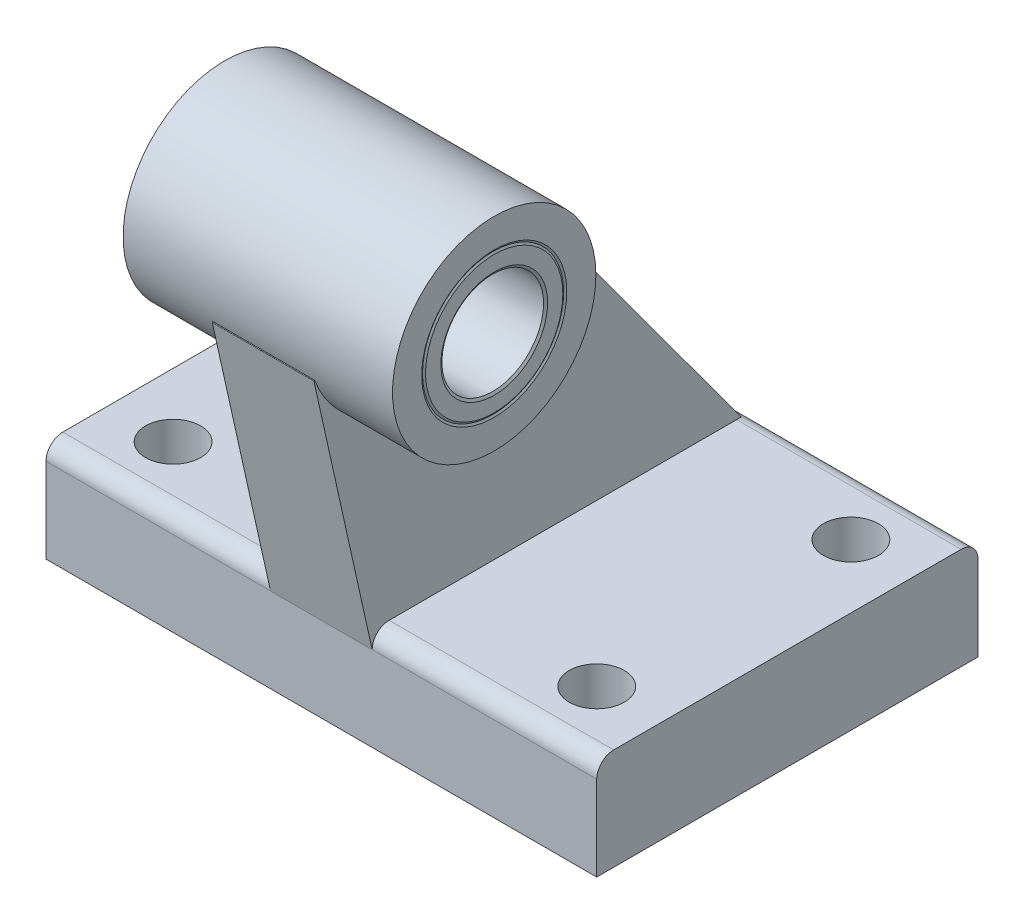
ISO-10303-21;
HEADER;
FILE_DESCRIPTION(('STEP AP214'),'2;1');
FILE_NAME('part.step','',(''),(''),'','','');
FILE_SCHEMA(('AUTOMOTIVE_DESIGN { 1 0 10303 214 1 1 1 1 }'));
ENDSEC;
DATA;
#1=APPLICATION_CONTEXT('core data for automotive mechanical design processes');
#2=APPLICATION_PROTOCOL_DEFINITION('international standard','automotive_design',2000,#1);
#3=PRODUCT_CONTEXT('',#1,'mechanical');
#4=PRODUCT('Part','Part','',(#3));
#5=PRODUCT_RELATED_PRODUCT_CATEGORY('part','',(#4));
#6=PRODUCT_DEFINITION_FORMATION('','',#4);
#7=PRODUCT_DEFINITION_CONTEXT('part definition',#1,'design');
#8=PRODUCT_DEFINITION('design','',#6,#7);
#9=PRODUCT_DEFINITION_SHAPE('','',#8);
#10=(LENGTH_UNIT() NAMED_UNIT(*) SI_UNIT(.MILLI.,.METRE.));
#11=(NAMED_UNIT(*) PLANE_ANGLE_UNIT() SI_UNIT($,.RADIAN.));
#12=(NAMED_UNIT(*) SI_UNIT($,.STERADIAN.) SOLID_ANGLE_UNIT());
#13=UNCERTAINTY_MEASURE_WITH_UNIT(LENGTH_MEASURE(1.E-05),#10,'distance_accuracy_value','');
#14=(GEOMETRIC_REPRESENTATION_CONTEXT(3) GLOBAL_UNCERTAINTY_ASSIGNED_CONTEXT((#13)) GLOBAL_UNIT_ASSIGNED_CONTEXT((#10,
#11,#12)) REPRESENTATION_CONTEXT('',''));
#15=CARTESIAN_POINT('',(0.,0.,0.));
#16=DIRECTION('',(0.,0.,1.));
#17=DIRECTION('',(1.,0.,0.));
#18=AXIS2_PLACEMENT_3D('',#15,#16,#17);
#19=CARTESIAN_POINT('',(32.5,10.008,20.508));
#20=DIRECTION('',(-1.,0.,0.));
#21=DIRECTION('',(0.,0.,1.));
#22=AXIS2_PLACEMENT_3D('',#19,#20,#21);
#23=CYLINDRICAL_SURFACE('',#22,1.99200000000001);
#24=CARTESIAN_POINT('',(6.,10.008,20.508));
#25=DIRECTION('',(-1.,0.,0.));
#26=DIRECTION('',(0.,0.,1.));
#27=AXIS2_PLACEMENT_3D('',#24,#25,#26);
#28=CIRCLE('',#27,1.99200000000001);
#29=CARTESIAN_POINT('',(6.,10.008,22.5));
#30=VERTEX_POINT('',#29);
#31=CARTESIAN_POINT('',(6.,12.,20.508));
#32=VERTEX_POINT('',#31);
#33=EDGE_CURVE('E192',#30,#32,#28,.T.);
#34=ORIENTED_EDGE('',*,*,#33,.F.);
#35=DIRECTION('',(-1.,0.,0.));
#36=VECTOR('',#35,1.);
#37=CARTESIAN_POINT('',(32.5,10.008,22.5));
#38=LINE('',#37,#36);
#39=CARTESIAN_POINT('',(32.5,10.008,22.5));
#40=VERTEX_POINT('',#39);
#41=EDGE_CURVE('E241',#40,#30,#38,.T.);
#42=ORIENTED_EDGE('',*,*,#41,.F.);
#43=CARTESIAN_POINT('',(32.5,10.008,20.508));
#44=DIRECTION('',(1.,0.,0.));
#45=DIRECTION('',(0.,0.,-1.));
#46=AXIS2_PLACEMENT_3D('',#43,#44,#45);
#47=CIRCLE('',#46,1.99200000000001);
#48=CARTESIAN_POINT('',(32.5,12.,20.508));
#49=VERTEX_POINT('',#48);
#50=EDGE_CURVE('E214',#49,#40,#47,.T.);
#51=ORIENTED_EDGE('',*,*,#50,.F.);
#52=DIRECTION('',(-1.,0.,0.));
#53=VECTOR('',#52,1.);
#54=CARTESIAN_POINT('',(32.5,12.,20.508));
#55=LINE('',#54,#53);
#56=EDGE_CURVE('E226',#49,#32,#55,.T.);
#57=ORIENTED_EDGE('',*,*,#56,.T.);
#58=EDGE_LOOP('',(#34,#42,#51,#57));
#59=FACE_BOUND('',#58,.T.);
#60=ADVANCED_FACE('F32',(#59),#23,.T.);
#61=CARTESIAN_POINT('',(32.5,10.008,22.5));
#62=DIRECTION('',(0.,0.,-1.));
#63=DIRECTION('',(-1.,0.,0.));
#64=AXIS2_PLACEMENT_3D('',#61,#62,#63);
#65=PLANE('',#64);
#66=DIRECTION('',(0.,1.,0.));
#67=VECTOR('',#66,1.);
#68=CARTESIAN_POINT('',(6.,10.008,22.5));
#69=LINE('',#68,#67);
#70=CARTESIAN_POINT('',(6.,9.984,22.5));
#71=VERTEX_POINT('',#70);
#72=EDGE_CURVE('E194',#71,#30,#69,.T.);
#73=ORIENTED_EDGE('',*,*,#72,.F.);
#74=DIRECTION('',(-1.,0.,0.));
#75=VECTOR('',#74,1.);
#76=CARTESIAN_POINT('',(6.,9.984,22.5));
#77=LINE('',#76,#75);
#78=CARTESIAN_POINT('',(-6.,9.984,22.5));
#79=VERTEX_POINT('',#78);
#80=EDGE_CURVE('E179',#71,#79,#77,.T.);
#81=ORIENTED_EDGE('',*,*,#80,.T.);
#82=DIRECTION('',(0.,1.,0.));
#83=VECTOR('',#82,1.);
#84=CARTESIAN_POINT('',(-6.,10.008,22.5));
#85=LINE('',#84,#83);
#86=CARTESIAN_POINT('',(-6.,10.008,22.5));
#87=VERTEX_POINT('',#86);
#88=EDGE_CURVE('E189',#79,#87,#85,.T.);
#89=ORIENTED_EDGE('',*,*,#88,.T.);
#90=CARTESIAN_POINT('',(-32.5,10.008,22.5));
#91=VERTEX_POINT('',#90);
#92=EDGE_CURVE('E240',#87,#91,#38,.T.);
#93=ORIENTED_EDGE('',*,*,#92,.T.);
#94=DIRECTION('',(0.,-1.,0.));
#95=VECTOR('',#94,1.);
#96=CARTESIAN_POINT('',(-32.5,10.008,22.5));
#97=LINE('',#96,#95);
#98=CARTESIAN_POINT('',(-32.5,0.,22.5));
#99=VERTEX_POINT('',#98);
#100=EDGE_CURVE('E199',#91,#99,#97,.T.);
#101=ORIENTED_EDGE('',*,*,#100,.T.);
#102=DIRECTION('',(-1.,0.,0.));
#103=VECTOR('',#102,1.);
#104=CARTESIAN_POINT('',(32.5,0.,22.5));
#105=LINE('',#104,#103);
#106=CARTESIAN_POINT('',(32.5,0.,22.5));
#107=VERTEX_POINT('',#106);
#108=EDGE_CURVE('E238',#107,#99,#105,.T.);
#109=ORIENTED_EDGE('',*,*,#108,.F.);
#110=DIRECTION('',(0.,-1.,0.));
#111=VECTOR('',#110,1.);
#112=CARTESIAN_POINT('',(32.5,10.008,22.5));
#113=LINE('',#112,#111);
#114=EDGE_CURVE('E216',#40,#107,#113,.T.);
#115=ORIENTED_EDGE('',*,*,#114,.F.);
#116=ORIENTED_EDGE('',*,*,#41,.T.);
#117=EDGE_LOOP('',(#73,#81,#89,#93,#101,#109,#115,#116));
#118=FACE_BOUND('',#117,.T.);
#119=ADVANCED_FACE('F336',(#118),#65,.F.);
#120=CARTESIAN_POINT('',(32.5,12.,-20.508));
#121=DIRECTION('',(0.,-1.,0.));
#122=DIRECTION('',(0.,0.,-1.));
#123=AXIS2_PLACEMENT_3D('',#120,#121,#122);
#124=PLANE('',#123);
#125=CARTESIAN_POINT('',(25.,12.,-15.));
#126=DIRECTION('',(0.,1.,0.));
#127=DIRECTION('',(0.,0.,1.));
#128=AXIS2_PLACEMENT_3D('',#125,#126,#127);
#129=CIRCLE('',#128,3.25);
#130=CARTESIAN_POINT('',(25.,12.,-11.75));
#131=VERTEX_POINT('',#130);
#132=EDGE_CURVE('E266',#131,#131,#129,.T.);
#133=ORIENTED_EDGE('',*,*,#132,.F.);
#134=EDGE_LOOP('',(#133));
#135=FACE_BOUND('',#134,.T.);
#136=CARTESIAN_POINT('',(25.,12.,15.));
#137=DIRECTION('',(0.,1.,0.));
#138=DIRECTION('',(0.,0.,1.));
#139=AXIS2_PLACEMENT_3D('',#136,#137,#138);
#140=CIRCLE('',#139,3.25);
#141=CARTESIAN_POINT('',(25.,12.,18.25));
#142=VERTEX_POINT('',#141);
#143=EDGE_CURVE('E278',#142,#142,#140,.T.);
#144=ORIENTED_EDGE('',*,*,#143,.F.);
#145=EDGE_LOOP('',(#144));
#146=FACE_BOUND('',#145,.T.);
#147=DIRECTION('',(0.,0.,-1.));
#148=VECTOR('',#147,1.);
#149=CARTESIAN_POINT('',(6.,12.,-20.508));
#150=LINE('',#149,#148);
#151=CARTESIAN_POINT('',(6.,12.,-20.508));
#152=VERTEX_POINT('',#151);
#153=EDGE_CURVE('E11',#32,#152,#150,.T.);
#154=ORIENTED_EDGE('',*,*,#153,.F.);
#155=ORIENTED_EDGE('',*,*,#56,.F.);
#156=DIRECTION('',(0.,0.,1.));
#157=VECTOR('',#156,1.);
#158=CARTESIAN_POINT('',(32.5,12.,-20.508));
#159=LINE('',#158,#157);
#160=CARTESIAN_POINT('',(32.5,12.,-20.508));
#161=VERTEX_POINT('',#160);
#162=EDGE_CURVE('E56',#161,#49,#159,.T.);
#163=ORIENTED_EDGE('',*,*,#162,.F.);
#164=DIRECTION('',(-1.,0.,0.));
#165=VECTOR('',#164,1.);
#166=CARTESIAN_POINT('',(32.5,12.,-20.508));
#167=LINE('',#166,#165);
#168=EDGE_CURVE('E230',#161,#152,#167,.T.);
#169=ORIENTED_EDGE('',*,*,#168,.T.);
#170=EDGE_LOOP('',(#154,#155,#163,#169));
#171=FACE_BOUND('',#170,.T.);
#172=ADVANCED_FACE('F361',(#135,#146,#171),#124,.F.);
#173=ORIENTED_EDGE('',*,*,#92,.F.);
#174=CARTESIAN_POINT('',(-6.,10.008,20.508));
#175=DIRECTION('',(-1.,0.,0.));
#176=DIRECTION('',(0.,0.,1.));
#177=AXIS2_PLACEMENT_3D('',#174,#175,#176);
#178=CIRCLE('',#177,1.99200000000001);
#179=CARTESIAN_POINT('',(-6.,12.,20.508));
#180=VERTEX_POINT('',#179);
#181=EDGE_CURVE('E186',#87,#180,#178,.T.);
#182=ORIENTED_EDGE('',*,*,#181,.T.);
#183=CARTESIAN_POINT('',(-32.5,12.,20.508));
#184=VERTEX_POINT('',#183);
#185=EDGE_CURVE('E225',#180,#184,#55,.T.);
#186=ORIENTED_EDGE('',*,*,#185,.T.);
#187=CARTESIAN_POINT('',(-32.5,10.008,20.508));
#188=DIRECTION('',(1.,0.,0.));
#189=DIRECTION('',(0.,0.,-1.));
#190=AXIS2_PLACEMENT_3D('',#187,#188,#189);
#191=CIRCLE('',#190,1.99200000000001);
#192=EDGE_CURVE('E196',#184,#91,#191,.T.);
#193=ORIENTED_EDGE('',*,*,#192,.T.);
#194=EDGE_LOOP('',(#173,#182,#186,#193));
#195=FACE_BOUND('',#194,.T.);
#196=ADVANCED_FACE('F34',(#195),#23,.T.);
#197=CARTESIAN_POINT('',(32.5,0.,22.5));
#198=DIRECTION('',(0.,1.,0.));
#199=DIRECTION('',(0.,0.,1.));
#200=AXIS2_PLACEMENT_3D('',#197,#198,#199);
#201=PLANE('',#200);
#202=CARTESIAN_POINT('',(25.,0.,-15.));
#203=DIRECTION('',(0.,1.,0.));
#204=DIRECTION('',(0.,0.,1.));
#205=AXIS2_PLACEMENT_3D('',#202,#203,#204);
#206=CIRCLE('',#205,3.25);
#207=CARTESIAN_POINT('',(25.,0.,-11.75));
#208=VERTEX_POINT('',#207);
#209=EDGE_CURVE('E269',#208,#208,#206,.T.);
#210=ORIENTED_EDGE('',*,*,#209,.T.);
#211=EDGE_LOOP('',(#210));
#212=FACE_BOUND('',#211,.T.);
#213=CARTESIAN_POINT('',(-25.,0.,-15.));
#214=DIRECTION('',(0.,1.,0.));
#215=DIRECTION('',(0.,0.,1.));
#216=AXIS2_PLACEMENT_3D('',#213,#214,#215);
#217=CIRCLE('',#216,3.25);
#218=CARTESIAN_POINT('',(-25.,0.,-11.75));
#219=VERTEX_POINT('',#218);
#220=EDGE_CURVE('E275',#219,#219,#217,.T.);
#221=ORIENTED_EDGE('',*,*,#220,.T.);
#222=EDGE_LOOP('',(#221));
#223=FACE_BOUND('',#222,.T.);
#224=CARTESIAN_POINT('',(25.,0.,15.));
#225=DIRECTION('',(0.,1.,0.));
#226=DIRECTION('',(0.,0.,1.));
#227=AXIS2_PLACEMENT_3D('',#224,#225,#226);
#228=CIRCLE('',#227,3.25);
#229=CARTESIAN_POINT('',(25.,0.,18.25));
#230=VERTEX_POINT('',#229);
#231=EDGE_CURVE('E281',#230,#230,#228,.T.);
#232=ORIENTED_EDGE('',*,*,#231,.T.);
#233=EDGE_LOOP('',(#232));
#234=FACE_BOUND('',#233,.T.);
#235=CARTESIAN_POINT('',(-25.,0.,15.));
#236=DIRECTION('',(0.,1.,0.));
#237=DIRECTION('',(0.,0.,1.));
#238=AXIS2_PLACEMENT_3D('',#235,#236,#237);
#239=CIRCLE('',#238,3.25);
#240=CARTESIAN_POINT('',(-25.,0.,18.25));
#241=VERTEX_POINT('',#240);
#242=EDGE_CURVE('E287',#241,#241,#239,.T.);
#243=ORIENTED_EDGE('',*,*,#242,.T.);
#244=EDGE_LOOP('',(#243));
#245=FACE_BOUND('',#244,.T.);
#246=ORIENTED_EDGE('',*,*,#108,.T.);
#247=DIRECTION('',(0.,0.,-1.));
#248=VECTOR('',#247,1.);
#249=CARTESIAN_POINT('',(-32.5,0.,22.5));
#250=LINE('',#249,#248);
#251=CARTESIAN_POINT('',(-32.5,0.,-22.5));
#252=VERTEX_POINT('',#251);
#253=EDGE_CURVE('E202',#99,#252,#250,.T.);
#254=ORIENTED_EDGE('',*,*,#253,.T.);
#255=DIRECTION('',(-1.,0.,0.));
#256=VECTOR('',#255,1.);
#257=CARTESIAN_POINT('',(32.5,0.,-22.5));
#258=LINE('',#257,#256);
#259=CARTESIAN_POINT('',(32.5,0.,-22.5));
#260=VERTEX_POINT('',#259);
#261=EDGE_CURVE('E236',#260,#252,#258,.T.);
#262=ORIENTED_EDGE('',*,*,#261,.F.);
#263=DIRECTION('',(0.,0.,-1.));
#264=VECTOR('',#263,1.);
#265=CARTESIAN_POINT('',(32.5,0.,22.5));
#266=LINE('',#265,#264);
#267=EDGE_CURVE('E218',#107,#260,#266,.T.);
#268=ORIENTED_EDGE('',*,*,#267,.F.);
#269=EDGE_LOOP('',(#246,#254,#262,#268));
#270=FACE_BOUND('',#269,.T.);
#271=ADVANCED_FACE('F367',(#212,#223,#234,#245,#270),#201,.F.);
#272=CARTESIAN_POINT('',(32.5,0.,-22.5));
#273=DIRECTION('',(0.,0.,1.));
#274=DIRECTION('',(1.,0.,0.));
#275=AXIS2_PLACEMENT_3D('',#272,#273,#274);
#276=PLANE('',#275);
#277=ORIENTED_EDGE('',*,*,#261,.T.);
#278=DIRECTION('',(0.,1.,0.));
#279=VECTOR('',#278,1.);
#280=CARTESIAN_POINT('',(-32.5,0.,-22.5));
#281=LINE('',#280,#279);
#282=CARTESIAN_POINT('',(-32.5,10.008,-22.5));
#283=VERTEX_POINT('',#282);
#284=EDGE_CURVE('E205',#252,#283,#281,.T.);
#285=ORIENTED_EDGE('',*,*,#284,.T.);
#286=DIRECTION('',(-1.,0.,0.));
#287=VECTOR('',#286,1.);
#288=CARTESIAN_POINT('',(32.5,10.008,-22.5));
#289=LINE('',#288,#287);
#290=CARTESIAN_POINT('',(32.5,10.008,-22.5));
#291=VERTEX_POINT('',#290);
#292=EDGE_CURVE('E233',#291,#283,#289,.T.);
#293=ORIENTED_EDGE('',*,*,#292,.F.);
#294=DIRECTION('',(0.,1.,0.));
#295=VECTOR('',#294,1.);
#296=CARTESIAN_POINT('',(32.5,0.,-22.5));
#297=LINE('',#296,#295);
#298=EDGE_CURVE('E220',#260,#291,#297,.T.);
#299=ORIENTED_EDGE('',*,*,#298,.F.);
#300=EDGE_LOOP('',(#277,#285,#293,#299));
#301=FACE_BOUND('',#300,.T.);
#302=ADVANCED_FACE('F372',(#301),#276,.F.);
#303=CARTESIAN_POINT('',(32.5,10.008,-20.508));
#304=DIRECTION('',(-1.,0.,0.));
#305=DIRECTION('',(0.,0.,1.));
#306=AXIS2_PLACEMENT_3D('',#303,#304,#305);
#307=CYLINDRICAL_SURFACE('',#306,1.992);
#308=ORIENTED_EDGE('',*,*,#292,.T.);
#309=CARTESIAN_POINT('',(-32.5,10.008,-20.508));
#310=DIRECTION('',(1.,0.,0.));
#311=DIRECTION('',(0.,0.,-1.));
#312=AXIS2_PLACEMENT_3D('',#309,#310,#311);
#313=CIRCLE('',#312,1.992);
#314=CARTESIAN_POINT('',(-32.5,12.,-20.508));
#315=VERTEX_POINT('',#314);
#316=EDGE_CURVE('E208',#283,#315,#313,.T.);
#317=ORIENTED_EDGE('',*,*,#316,.T.);
#318=CARTESIAN_POINT('',(-6.,12.,-20.508));
#319=VERTEX_POINT('',#318);
#320=EDGE_CURVE('E229',#319,#315,#167,.T.);
#321=ORIENTED_EDGE('',*,*,#320,.F.);
#322=EDGE_CURVE('E234',#152,#319,#167,.T.);
#323=ORIENTED_EDGE('',*,*,#322,.F.);
#324=ORIENTED_EDGE('',*,*,#168,.F.);
#325=CARTESIAN_POINT('',(32.5,10.008,-20.508));
#326=DIRECTION('',(1.,0.,0.));
#327=DIRECTION('',(0.,0.,-1.));
#328=AXIS2_PLACEMENT_3D('',#325,#326,#327);
#329=CIRCLE('',#328,1.992);
#330=EDGE_CURVE('E222',#291,#161,#329,.T.);
#331=ORIENTED_EDGE('',*,*,#330,.F.);
#332=EDGE_LOOP('',(#308,#317,#321,#323,#324,#331));
#333=FACE_BOUND('',#332,.T.);
#334=ADVANCED_FACE('F322',(#333),#307,.T.);
#335=CARTESIAN_POINT('',(-25.,12.,-15.));
#336=DIRECTION('',(0.,1.,0.));
#337=DIRECTION('',(0.,0.,1.));
#338=AXIS2_PLACEMENT_3D('',#335,#336,#337);
#339=CIRCLE('',#338,3.25);
#340=CARTESIAN_POINT('',(-25.,12.,-11.75));
#341=VERTEX_POINT('',#340);
#342=EDGE_CURVE('E272',#341,#341,#339,.T.);
#343=ORIENTED_EDGE('',*,*,#342,.F.);
#344=EDGE_LOOP('',(#343));
#345=FACE_BOUND('',#344,.T.);
#346=CARTESIAN_POINT('',(-25.,12.,15.));
#347=DIRECTION('',(0.,1.,0.));
#348=DIRECTION('',(0.,0.,1.));
#349=AXIS2_PLACEMENT_3D('',#346,#347,#348);
#350=CIRCLE('',#349,3.25);
#351=CARTESIAN_POINT('',(-25.,12.,18.25));
#352=VERTEX_POINT('',#351);
#353=EDGE_CURVE('E284',#352,#352,#350,.T.);
#354=ORIENTED_EDGE('',*,*,#353,.F.);
#355=EDGE_LOOP('',(#354));
#356=FACE_BOUND('',#355,.T.);
#357=ORIENTED_EDGE('',*,*,#185,.F.);
#358=DIRECTION('',(0.,0.,-1.));
#359=VECTOR('',#358,1.);
#360=CARTESIAN_POINT('',(-6.,12.,-20.508));
#361=LINE('',#360,#359);
#362=EDGE_CURVE('E41',#180,#319,#361,.T.);
#363=ORIENTED_EDGE('',*,*,#362,.T.);
#364=ORIENTED_EDGE('',*,*,#320,.T.);
#365=DIRECTION('',(0.,0.,1.));
#366=VECTOR('',#365,1.);
#367=CARTESIAN_POINT('',(-32.5,12.,-20.508));
#368=LINE('',#367,#366);
#369=EDGE_CURVE('E211',#315,#184,#368,.T.);
#370=ORIENTED_EDGE('',*,*,#369,.T.);
#371=EDGE_LOOP('',(#357,#363,#364,#370));
#372=FACE_BOUND('',#371,.T.);
#373=ADVANCED_FACE('F325',(#345,#356,#372),#124,.F.);
#374=CARTESIAN_POINT('',(32.5,10.008,20.508));
#375=DIRECTION('',(1.,0.,0.));
#376=DIRECTION('',(0.,0.,-1.));
#377=AXIS2_PLACEMENT_3D('',#374,#375,#376);
#378=PLANE('',#377);
#379=ORIENTED_EDGE('',*,*,#50,.T.);
#380=ORIENTED_EDGE('',*,*,#114,.T.);
#381=ORIENTED_EDGE('',*,*,#267,.T.);
#382=ORIENTED_EDGE('',*,*,#298,.T.);
#383=ORIENTED_EDGE('',*,*,#330,.T.);
#384=ORIENTED_EDGE('',*,*,#162,.T.);
#385=EDGE_LOOP('',(#379,#380,#381,#382,#383,#384));
#386=FACE_BOUND('',#385,.T.);
#387=ADVANCED_FACE('F351',(#386),#378,.T.);
#388=CARTESIAN_POINT('',(-32.5,10.008,20.508));
#389=DIRECTION('',(1.,0.,0.));
#390=DIRECTION('',(0.,0.,-1.));
#391=AXIS2_PLACEMENT_3D('',#388,#389,#390);
#392=PLANE('',#391);
#393=ORIENTED_EDGE('',*,*,#192,.F.);
#394=ORIENTED_EDGE('',*,*,#369,.F.);
#395=ORIENTED_EDGE('',*,*,#316,.F.);
#396=ORIENTED_EDGE('',*,*,#284,.F.);
#397=ORIENTED_EDGE('',*,*,#253,.F.);
#398=ORIENTED_EDGE('',*,*,#100,.F.);
#399=EDGE_LOOP('',(#393,#394,#395,#396,#397,#398));
#400=FACE_BOUND('',#399,.T.);
#401=ADVANCED_FACE('F328',(#400),#392,.F.);
#402=CARTESIAN_POINT('',(6.,12.,20.484));
#403=DIRECTION('',(0.,1.,0.));
#404=DIRECTION('',(0.,0.,1.));
#405=AXIS2_PLACEMENT_3D('',#402,#403,#404);
#406=PLANE('',#405);
#407=DIRECTION('',(0.,0.,-1.));
#408=VECTOR('',#407,1.);
#409=CARTESIAN_POINT('',(6.,12.,20.484));
#410=LINE('',#409,#408);
#411=CARTESIAN_POINT('',(6.,12.,-21.0411718809562));
#412=VERTEX_POINT('',#411);
#413=EDGE_CURVE('E307',#152,#412,#410,.T.);
#414=ORIENTED_EDGE('',*,*,#413,.F.);
#415=ORIENTED_EDGE('',*,*,#322,.T.);
#416=DIRECTION('',(0.,0.,-1.));
#417=VECTOR('',#416,1.);
#418=CARTESIAN_POINT('',(-6.,12.,20.484));
#419=LINE('',#418,#417);
#420=CARTESIAN_POINT('',(-6.,12.,-21.0411718809562));
#421=VERTEX_POINT('',#420);
#422=EDGE_CURVE('E299',#319,#421,#419,.T.);
#423=ORIENTED_EDGE('',*,*,#422,.T.);
#424=DIRECTION('',(-1.,0.,0.));
#425=VECTOR('',#424,1.);
#426=CARTESIAN_POINT('',(6.,12.,-21.0411718809562));
#427=LINE('',#426,#425);
#428=EDGE_CURVE('E171',#412,#421,#427,.T.);
#429=ORIENTED_EDGE('',*,*,#428,.F.);
#430=EDGE_LOOP('',(#414,#415,#423,#429));
#431=FACE_BOUND('',#430,.T.);
#432=ADVANCED_FACE('F319',(#431),#406,.F.);
#433=CARTESIAN_POINT('',(6.,45.,18.));
#434=DIRECTION('',(-1.,0.,0.));
#435=DIRECTION('',(0.,0.,1.));
#436=AXIS2_PLACEMENT_3D('',#433,#434,#435);
#437=PLANE('',#436);
#438=DIRECTION('',(0.,-0.976114346870211,-0.217257409158216));
#439=VECTOR('',#438,1.);
#440=CARTESIAN_POINT('',(6.,40.8807212463324,29.3767984314386));
#441=LINE('',#440,#439);
#442=CARTESIAN_POINT('',(6.,40.8807212463324,29.3767984314386));
#443=VERTEX_POINT('',#442);
#444=EDGE_CURVE('E305',#443,#71,#441,.T.);
#445=ORIENTED_EDGE('',*,*,#444,.T.);
#446=ORIENTED_EDGE('',*,*,#72,.T.);
#447=ORIENTED_EDGE('',*,*,#33,.T.);
#448=ORIENTED_EDGE('',*,*,#153,.T.);
#449=ORIENTED_EDGE('',*,*,#413,.T.);
#450=DIRECTION('',(0.,0.806785681624638,0.590844195981875));
#451=VECTOR('',#450,1.);
#452=CARTESIAN_POINT('',(6.,12.,-21.0411718809562));
#453=LINE('',#452,#451);
#454=CARTESIAN_POINT('',(6.,50.8402633482262,7.40323992800791));
#455=VERTEX_POINT('',#454);
#456=EDGE_CURVE('E173',#412,#455,#453,.T.);
#457=ORIENTED_EDGE('',*,*,#456,.T.);
#458=CARTESIAN_POINT('',(6.,50.8107211384271,7.44357921208915));
#459=DIRECTION('',(1.,0.,0.));
#460=DIRECTION('',(0.,0.,-1.));
#461=AXIS2_PLACEMENT_3D('',#458,#459,#460);
#462=CIRCLE('',#461,0.0499999999999936);
#463=CARTESIAN_POINT('',(6.,50.7866102694468,7.48738179188775));
#464=VERTEX_POINT('',#463);
#465=EDGE_CURVE('E169',#455,#464,#462,.T.);
#466=ORIENTED_EDGE('',*,*,#465,.T.);
#467=CARTESIAN_POINT('',(6.,45.,18.));
#468=DIRECTION('',(-1.,0.,0.));
#469=DIRECTION('',(0.,0.,1.));
#470=AXIS2_PLACEMENT_3D('',#467,#468,#469);
#471=CIRCLE('',#470,12.);
#472=CARTESIAN_POINT('',(6.,40.9086314856003,29.2809885949494));
#473=VERTEX_POINT('',#472);
#474=EDGE_CURVE('E152',#464,#473,#471,.T.);
#475=ORIENTED_EDGE('',*,*,#474,.T.);
#476=CARTESIAN_POINT('',(6.,40.8915841167904,29.3279927140951));
#477=DIRECTION('',(1.,0.,0.));
#478=DIRECTION('',(0.,0.,-1.));
#479=AXIS2_PLACEMENT_3D('',#476,#477,#478);
#480=CIRCLE('',#479,0.0500000000000237);
#481=EDGE_CURVE('E303',#473,#443,#480,.T.);
#482=ORIENTED_EDGE('',*,*,#481,.T.);
#483=EDGE_LOOP('',(#445,#446,#447,#448,#449,#457,#466,#475,#482));
#484=FACE_BOUND('',#483,.T.);
#485=ADVANCED_FACE('F310',(#484),#437,.F.);
#486=CARTESIAN_POINT('',(-6.,45.,18.));
#487=DIRECTION('',(-1.,0.,0.));
#488=DIRECTION('',(0.,0.,1.));
#489=AXIS2_PLACEMENT_3D('',#486,#487,#488);
#490=PLANE('',#489);
#491=ORIENTED_EDGE('',*,*,#88,.F.);
#492=DIRECTION('',(0.,-0.976114346870211,-0.217257409158216));
#493=VECTOR('',#492,1.);
#494=CARTESIAN_POINT('',(-6.,40.8807212463324,29.3767984314386));
#495=LINE('',#494,#493);
#496=CARTESIAN_POINT('',(-6.,40.8807212463324,29.3767984314386));
#497=VERTEX_POINT('',#496);
#498=EDGE_CURVE('E296',#497,#79,#495,.T.);
#499=ORIENTED_EDGE('',*,*,#498,.F.);
#500=CARTESIAN_POINT('',(-6.,40.8915841167904,29.3279927140951));
#501=DIRECTION('',(1.,0.,0.));
#502=DIRECTION('',(0.,0.,-1.));
#503=AXIS2_PLACEMENT_3D('',#500,#501,#502);
#504=CIRCLE('',#503,0.0500000000000237);
#505=CARTESIAN_POINT('',(-6.,40.9086314856003,29.2809885949494));
#506=VERTEX_POINT('',#505);
#507=EDGE_CURVE('E161',#506,#497,#504,.T.);
#508=ORIENTED_EDGE('',*,*,#507,.F.);
#509=CARTESIAN_POINT('',(-6.,45.,18.));
#510=DIRECTION('',(-1.,0.,0.));
#511=DIRECTION('',(0.,0.,1.));
#512=AXIS2_PLACEMENT_3D('',#509,#510,#511);
#513=CIRCLE('',#512,12.);
#514=CARTESIAN_POINT('',(-6.,50.7866102623341,7.4873817879726));
#515=VERTEX_POINT('',#514);
#516=EDGE_CURVE('E157',#515,#506,#513,.T.);
#517=ORIENTED_EDGE('',*,*,#516,.F.);
#518=CARTESIAN_POINT('',(-6.,50.8107211384271,7.44357921208915));
#519=DIRECTION('',(1.,0.,0.));
#520=DIRECTION('',(0.,0.,-1.));
#521=AXIS2_PLACEMENT_3D('',#518,#519,#520);
#522=CIRCLE('',#521,0.0499999999999936);
#523=CARTESIAN_POINT('',(-6.,50.8402633482262,7.40323992800791));
#524=VERTEX_POINT('',#523);
#525=EDGE_CURVE('E140',#524,#515,#522,.T.);
#526=ORIENTED_EDGE('',*,*,#525,.F.);
#527=DIRECTION('',(0.,0.806785681624638,0.590844195981875));
#528=VECTOR('',#527,1.);
#529=CARTESIAN_POINT('',(-6.,12.,-21.0411718809562));
#530=LINE('',#529,#528);
#531=EDGE_CURVE('E153',#421,#524,#530,.T.);
#532=ORIENTED_EDGE('',*,*,#531,.F.);
#533=ORIENTED_EDGE('',*,*,#422,.F.);
#534=ORIENTED_EDGE('',*,*,#362,.F.);
#535=ORIENTED_EDGE('',*,*,#181,.F.);
#536=EDGE_LOOP('',(#491,#499,#508,#517,#526,#532,#533,#534,#535));
#537=FACE_BOUND('',#536,.T.);
#538=ADVANCED_FACE('F158',(#537),#490,.T.);
#539=CARTESIAN_POINT('',(6.,40.8915841167904,29.3279927140951));
#540=DIRECTION('',(-1.,0.,0.));
#541=DIRECTION('',(0.,0.,1.));
#542=AXIS2_PLACEMENT_3D('',#539,#540,#541);
#543=CYLINDRICAL_SURFACE('',#542,0.0500000000000237);
#544=DIRECTION('',(-1.,0.,0.));
#545=VECTOR('',#544,1.);
#546=CARTESIAN_POINT('',(6.,40.9086314856003,29.2809885949494));
#547=LINE('',#546,#545);
#548=EDGE_CURVE('E184',#473,#506,#547,.T.);
#549=ORIENTED_EDGE('',*,*,#548,.T.);
#550=ORIENTED_EDGE('',*,*,#507,.T.);
#551=DIRECTION('',(-1.,0.,0.));
#552=VECTOR('',#551,1.);
#553=CARTESIAN_POINT('',(6.,40.8807212463324,29.3767984314386));
#554=LINE('',#553,#552);
#555=EDGE_CURVE('E182',#443,#497,#554,.T.);
#556=ORIENTED_EDGE('',*,*,#555,.F.);
#557=ORIENTED_EDGE('',*,*,#481,.F.);
#558=EDGE_LOOP('',(#549,#550,#556,#557));
#559=FACE_BOUND('',#558,.T.);
#560=ADVANCED_FACE('F343',(#559),#543,.T.);
#561=CARTESIAN_POINT('',(6.,40.8807212463324,29.3767984314386));
#562=DIRECTION('',(0.,0.217257409158216,-0.976114346870211));
#563=DIRECTION('',(0.,0.976114346870211,0.217257409158216));
#564=AXIS2_PLACEMENT_3D('',#561,#562,#563);
#565=PLANE('',#564);
#566=ORIENTED_EDGE('',*,*,#555,.T.);
#567=ORIENTED_EDGE('',*,*,#498,.T.);
#568=ORIENTED_EDGE('',*,*,#80,.F.);
#569=ORIENTED_EDGE('',*,*,#444,.F.);
#570=EDGE_LOOP('',(#566,#567,#568,#569));
#571=FACE_BOUND('',#570,.T.);
#572=ADVANCED_FACE('F340',(#571),#565,.F.);
#573=CARTESIAN_POINT('',(6.,12.,-21.0411718809562));
#574=DIRECTION('',(0.,-0.590844195981875,0.806785681624638));
#575=DIRECTION('',(0.,-0.806785681624638,-0.590844195981875));
#576=AXIS2_PLACEMENT_3D('',#573,#574,#575);
#577=PLANE('',#576);
#578=ORIENTED_EDGE('',*,*,#428,.T.);
#579=ORIENTED_EDGE('',*,*,#531,.T.);
#580=DIRECTION('',(-1.,0.,0.));
#581=VECTOR('',#580,1.);
#582=CARTESIAN_POINT('',(6.,50.8402633482262,7.40323992800791));
#583=LINE('',#582,#581);
#584=EDGE_CURVE('E148',#455,#524,#583,.T.);
#585=ORIENTED_EDGE('',*,*,#584,.F.);
#586=ORIENTED_EDGE('',*,*,#456,.F.);
#587=EDGE_LOOP('',(#578,#579,#585,#586));
#588=FACE_BOUND('',#587,.T.);
#589=ADVANCED_FACE('F314',(#588),#577,.F.);
#590=CARTESIAN_POINT('',(6.,50.8107211384271,7.44357921208915));
#591=DIRECTION('',(-1.,0.,0.));
#592=DIRECTION('',(0.,0.,1.));
#593=AXIS2_PLACEMENT_3D('',#590,#591,#592);
#594=CYLINDRICAL_SURFACE('',#593,0.0499999999999936);
#595=ORIENTED_EDGE('',*,*,#584,.T.);
#596=ORIENTED_EDGE('',*,*,#525,.T.);
#597=DIRECTION('',(-1.,0.,0.));
#598=VECTOR('',#597,1.);
#599=CARTESIAN_POINT('',(6.,50.7866102694468,7.48738179188775));
#600=LINE('',#599,#598);
#601=EDGE_CURVE('E145',#464,#515,#600,.T.);
#602=ORIENTED_EDGE('',*,*,#601,.F.);
#603=ORIENTED_EDGE('',*,*,#465,.F.);
#604=EDGE_LOOP('',(#595,#596,#602,#603));
#605=FACE_BOUND('',#604,.T.);
#606=ADVANCED_FACE('F142',(#605),#594,.T.);
#607=CARTESIAN_POINT('',(15.9,45.,18.));
#608=DIRECTION('',(-1.,0.,0.));
#609=DIRECTION('',(0.,0.,1.));
#610=AXIS2_PLACEMENT_3D('',#607,#608,#609);
#611=CYLINDRICAL_SURFACE('',#610,12.);
#612=ORIENTED_EDGE('',*,*,#548,.F.);
#613=ORIENTED_EDGE('',*,*,#474,.F.);
#614=ORIENTED_EDGE('',*,*,#601,.T.);
#615=ORIENTED_EDGE('',*,*,#516,.T.);
#616=EDGE_LOOP('',(#612,#613,#614,#615));
#617=FACE_BOUND('',#616,.T.);
#618=CARTESIAN_POINT('',(15.9,45.,18.));
#619=DIRECTION('',(1.,0.,0.));
#620=DIRECTION('',(0.,0.,-1.));
#621=AXIS2_PLACEMENT_3D('',#618,#619,#620);
#622=CIRCLE('',#621,12.);
#623=CARTESIAN_POINT('',(15.9,45.,6.));
#624=VERTEX_POINT('',#623);
#625=EDGE_CURVE('E164',#624,#624,#622,.T.);
#626=ORIENTED_EDGE('',*,*,#625,.F.);
#627=EDGE_LOOP('',(#626));
#628=FACE_BOUND('',#627,.T.);
#629=CARTESIAN_POINT('',(-15.9,45.,18.));
#630=DIRECTION('',(1.,0.,0.));
#631=DIRECTION('',(0.,0.,-1.));
#632=AXIS2_PLACEMENT_3D('',#629,#630,#631);
#633=CIRCLE('',#632,12.);
#634=CARTESIAN_POINT('',(-15.9,45.,6.));
#635=VERTEX_POINT('',#634);
#636=EDGE_CURVE('E290',#635,#635,#633,.T.);
#637=ORIENTED_EDGE('',*,*,#636,.T.);
#638=EDGE_LOOP('',(#637));
#639=FACE_BOUND('',#638,.T.);
#640=ADVANCED_FACE('F166',(#617,#628,#639),#611,.T.);
#641=CARTESIAN_POINT('',(15.9,45.,18.));
#642=DIRECTION('',(1.,0.,0.));
#643=DIRECTION('',(0.,0.,-1.));
#644=AXIS2_PLACEMENT_3D('',#641,#642,#643);
#645=PLANE('',#644);
#646=CARTESIAN_POINT('',(15.9,45.,18.));
#647=DIRECTION('',(1.,0.,0.));
#648=DIRECTION('',(0.,0.,-1.));
#649=AXIS2_PLACEMENT_3D('',#646,#647,#648);
#650=CIRCLE('',#649,8.564);
#651=CARTESIAN_POINT('',(15.9,45.,9.436));
#652=VERTEX_POINT('',#651);
#653=EDGE_CURVE('E250',#652,#652,#650,.T.);
#654=ORIENTED_EDGE('',*,*,#653,.F.);
#655=EDGE_LOOP('',(#654));
#656=FACE_BOUND('',#655,.T.);
#657=ORIENTED_EDGE('',*,*,#625,.T.);
#658=EDGE_LOOP('',(#657));
#659=FACE_BOUND('',#658,.T.);
#660=ADVANCED_FACE('F452',(#656,#659),#645,.T.);
#661=CARTESIAN_POINT('',(-15.9,45.,18.));
#662=DIRECTION('',(1.,0.,0.));
#663=DIRECTION('',(0.,0.,-1.));
#664=AXIS2_PLACEMENT_3D('',#661,#662,#663);
#665=PLANE('',#664);
#666=CARTESIAN_POINT('',(-15.9,45.,18.));
#667=DIRECTION('',(1.,0.,0.));
#668=DIRECTION('',(0.,0.,-1.));
#669=AXIS2_PLACEMENT_3D('',#666,#667,#668);
#670=CIRCLE('',#669,8.564);
#671=CARTESIAN_POINT('',(-15.9,45.,9.436));
#672=VERTEX_POINT('',#671);
#673=EDGE_CURVE('E263',#672,#672,#670,.T.);
#674=ORIENTED_EDGE('',*,*,#673,.T.);
#675=EDGE_LOOP('',(#674));
#676=FACE_BOUND('',#675,.T.);
#677=ORIENTED_EDGE('',*,*,#636,.F.);
#678=EDGE_LOOP('',(#677));
#679=FACE_BOUND('',#678,.T.);
#680=ADVANCED_FACE('F457',(#676,#679),#665,.F.);
#681=CARTESIAN_POINT('',(-25.,12.,15.));
#682=DIRECTION('',(0.,1.,0.));
#683=DIRECTION('',(0.,0.,1.));
#684=AXIS2_PLACEMENT_3D('',#681,#682,#683);
#685=CYLINDRICAL_SURFACE('',#684,3.25);
#686=ORIENTED_EDGE('',*,*,#242,.F.);
#687=EDGE_LOOP('',(#686));
#688=FACE_BOUND('',#687,.T.);
#689=ORIENTED_EDGE('',*,*,#353,.T.);
#690=EDGE_LOOP('',(#689));
#691=FACE_BOUND('',#690,.T.);
#692=ADVANCED_FACE('F469',(#688,#691),#685,.F.);
#693=CARTESIAN_POINT('',(25.,12.,15.));
#694=DIRECTION('',(0.,1.,0.));
#695=DIRECTION('',(0.,0.,1.));
#696=AXIS2_PLACEMENT_3D('',#693,#694,#695);
#697=CYLINDRICAL_SURFACE('',#696,3.25);
#698=ORIENTED_EDGE('',*,*,#231,.F.);
#699=EDGE_LOOP('',(#698));
#700=FACE_BOUND('',#699,.T.);
#701=ORIENTED_EDGE('',*,*,#143,.T.);
#702=EDGE_LOOP('',(#701));
#703=FACE_BOUND('',#702,.T.);
#704=ADVANCED_FACE('F412',(#700,#703),#697,.F.);
#705=CARTESIAN_POINT('',(-25.,12.,-15.));
#706=DIRECTION('',(0.,1.,0.));
#707=DIRECTION('',(0.,0.,1.));
#708=AXIS2_PLACEMENT_3D('',#705,#706,#707);
#709=CYLINDRICAL_SURFACE('',#708,3.25);
#710=ORIENTED_EDGE('',*,*,#220,.F.);
#711=EDGE_LOOP('',(#710));
#712=FACE_BOUND('',#711,.T.);
#713=ORIENTED_EDGE('',*,*,#342,.T.);
#714=EDGE_LOOP('',(#713));
#715=FACE_BOUND('',#714,.T.);
#716=ADVANCED_FACE('F417',(#712,#715),#709,.F.);
#717=CARTESIAN_POINT('',(25.,12.,-15.));
#718=DIRECTION('',(0.,1.,0.));
#719=DIRECTION('',(0.,0.,1.));
#720=AXIS2_PLACEMENT_3D('',#717,#718,#719);
#721=CYLINDRICAL_SURFACE('',#720,3.25);
#722=ORIENTED_EDGE('',*,*,#209,.F.);
#723=EDGE_LOOP('',(#722));
#724=FACE_BOUND('',#723,.T.);
#725=ORIENTED_EDGE('',*,*,#132,.T.);
#726=EDGE_LOOP('',(#725));
#727=FACE_BOUND('',#726,.T.);
#728=ADVANCED_FACE('F421',(#724,#727),#721,.F.);
#729=CARTESIAN_POINT('',(-15.6113248654052,45.,18.));
#730=DIRECTION('',(-1.,0.,0.));
#731=DIRECTION('',(0.,0.,1.));
#732=AXIS2_PLACEMENT_3D('',#729,#730,#731);
#733=CONICAL_SURFACE('',#732,8.064,1.04719755119661);
#734=CARTESIAN_POINT('',(-15.766054737548,45.,18.));
#735=DIRECTION('',(1.,0.,0.));
#736=DIRECTION('',(0.,0.,-1.));
#737=AXIS2_PLACEMENT_3D('',#734,#735,#736);
#738=CIRCLE('',#737,8.33199999999999);
#739=CARTESIAN_POINT('',(-15.766054737548,45.,9.66800000000001));
#740=VERTEX_POINT('',#739);
#741=EDGE_CURVE('E36',#740,#740,#738,.T.);
#742=ORIENTED_EDGE('',*,*,#741,.T.);
#743=EDGE_LOOP('',(#742));
#744=FACE_BOUND('',#743,.T.);
#745=ORIENTED_EDGE('',*,*,#673,.F.);
#746=EDGE_LOOP('',(#745));
#747=FACE_BOUND('',#746,.T.);
#748=ADVANCED_FACE('F444',(#744,#747),#733,.F.);
#749=CARTESIAN_POINT('',(15.9,45.,18.));
#750=DIRECTION('',(1.,0.,0.));
#751=DIRECTION('',(0.,0.,-1.));
#752=AXIS2_PLACEMENT_3D('',#749,#750,#751);
#753=CONICAL_SURFACE('',#752,8.564,1.04719755119662);
#754=CARTESIAN_POINT('',(15.766054737548,45.,18.));
#755=DIRECTION('',(-1.,0.,0.));
#756=DIRECTION('',(0.,0.,1.));
#757=AXIS2_PLACEMENT_3D('',#754,#755,#756);
#758=CIRCLE('',#757,8.33199999999999);
#759=CARTESIAN_POINT('',(15.766054737548,45.,26.332));
#760=VERTEX_POINT('',#759);
#761=EDGE_CURVE('E244',#760,#760,#758,.T.);
#762=ORIENTED_EDGE('',*,*,#761,.T.);
#763=EDGE_LOOP('',(#762));
#764=FACE_BOUND('',#763,.T.);
#765=ORIENTED_EDGE('',*,*,#653,.T.);
#766=EDGE_LOOP('',(#765));
#767=FACE_BOUND('',#766,.T.);
#768=ADVANCED_FACE('F479',(#764,#767),#753,.F.);
#769=CARTESIAN_POINT('',(-15.7267949192431,45.,18.));
#770=DIRECTION('',(1.,0.,0.));
#771=DIRECTION('',(0.,0.,-1.));
#772=AXIS2_PLACEMENT_3D('',#769,#770,#771);
#773=CONICAL_SURFACE('',#772,8.4,1.04719755119656);
#774=CARTESIAN_POINT('',(-15.9,45.,18.));
#775=DIRECTION('',(1.,0.,0.));
#776=DIRECTION('',(0.,0.,-1.));
#777=AXIS2_PLACEMENT_3D('',#774,#775,#776);
#778=CIRCLE('',#777,8.1);
#779=CARTESIAN_POINT('',(-15.9,45.,9.9));
#780=VERTEX_POINT('',#779);
#781=EDGE_CURVE('E686',#780,#780,#778,.T.);
#782=ORIENTED_EDGE('',*,*,#781,.T.);
#783=EDGE_LOOP('',(#782));
#784=FACE_BOUND('',#783,.T.);
#785=ORIENTED_EDGE('',*,*,#741,.F.);
#786=EDGE_LOOP('',(#785));
#787=FACE_BOUND('',#786,.T.);
#788=ADVANCED_FACE('F489',(#784,#787),#773,.T.);
#789=CARTESIAN_POINT('',(15.9,45.,18.));
#790=DIRECTION('',(-1.,0.,0.));
#791=DIRECTION('',(0.,0.,1.));
#792=AXIS2_PLACEMENT_3D('',#789,#790,#791);
#793=CONICAL_SURFACE('',#792,8.1,1.04719755119657);
#794=CARTESIAN_POINT('',(15.9,45.,18.));
#795=DIRECTION('',(1.,0.,0.));
#796=DIRECTION('',(0.,0.,-1.));
#797=AXIS2_PLACEMENT_3D('',#794,#795,#796);
#798=CIRCLE('',#797,8.1);
#799=CARTESIAN_POINT('',(15.9,45.,9.9));
#800=VERTEX_POINT('',#799);
#801=EDGE_CURVE('E680',#800,#800,#798,.T.);
#802=ORIENTED_EDGE('',*,*,#801,.F.);
#803=EDGE_LOOP('',(#802));
#804=FACE_BOUND('',#803,.T.);
#805=ORIENTED_EDGE('',*,*,#761,.F.);
#806=EDGE_LOOP('',(#805));
#807=FACE_BOUND('',#806,.T.);
#808=ADVANCED_FACE('F498',(#804,#807),#793,.T.);
#809=CARTESIAN_POINT('',(-15.9,53.1,18.));
#810=DIRECTION('',(-1.,0.,0.));
#811=DIRECTION('',(0.,0.,1.));
#812=AXIS2_PLACEMENT_3D('',#809,#810,#811);
#813=PLANE('',#812);
#814=CARTESIAN_POINT('',(-15.9,45.,18.));
#815=DIRECTION('',(1.,0.,0.));
#816=DIRECTION('',(0.,0.,-1.));
#817=AXIS2_PLACEMENT_3D('',#814,#815,#816);
#818=CIRCLE('',#817,6.3);
#819=CARTESIAN_POINT('',(-15.9,45.,11.7));
#820=VERTEX_POINT('',#819);
#821=EDGE_CURVE('E246',#820,#820,#818,.T.);
#822=ORIENTED_EDGE('',*,*,#821,.T.);
#823=EDGE_LOOP('',(#822));
#824=FACE_BOUND('',#823,.T.);
#825=ORIENTED_EDGE('',*,*,#781,.F.);
#826=EDGE_LOOP('',(#825));
#827=FACE_BOUND('',#826,.T.);
#828=ADVANCED_FACE('F508',(#824,#827),#813,.T.);
#829=CARTESIAN_POINT('',(-15.9,45.,18.));
#830=DIRECTION('',(-1.,0.,0.));
#831=DIRECTION('',(0.,0.,1.));
#832=AXIS2_PLACEMENT_3D('',#829,#830,#831);
#833=CONICAL_SURFACE('',#832,6.3,1.04719755119656);
#834=CARTESIAN_POINT('',(-15.7267949192431,45.,18.));
#835=DIRECTION('',(1.,0.,0.));
#836=DIRECTION('',(0.,0.,-1.));
#837=AXIS2_PLACEMENT_3D('',#834,#835,#836);
#838=CIRCLE('',#837,6.);
#839=CARTESIAN_POINT('',(-15.7267949192431,45.,12.));
#840=VERTEX_POINT('',#839);
#841=EDGE_CURVE('E252',#840,#840,#838,.T.);
#842=ORIENTED_EDGE('',*,*,#841,.T.);
#843=EDGE_LOOP('',(#842));
#844=FACE_BOUND('',#843,.T.);
#845=ORIENTED_EDGE('',*,*,#821,.F.);
#846=EDGE_LOOP('',(#845));
#847=FACE_BOUND('',#846,.T.);
#848=ADVANCED_FACE('F518',(#844,#847),#833,.F.);
#849=CARTESIAN_POINT('',(15.9,45.,18.));
#850=DIRECTION('',(1.,0.,0.));
#851=DIRECTION('',(0.,0.,-1.));
#852=AXIS2_PLACEMENT_3D('',#849,#850,#851);
#853=CYLINDRICAL_SURFACE('',#852,6.);
#854=CARTESIAN_POINT('',(15.7267949192431,45.,18.));
#855=DIRECTION('',(1.,0.,0.));
#856=DIRECTION('',(0.,0.,-1.));
#857=AXIS2_PLACEMENT_3D('',#854,#855,#856);
#858=CIRCLE('',#857,6.);
#859=CARTESIAN_POINT('',(15.7267949192431,45.,12.));
#860=VERTEX_POINT('',#859);
#861=EDGE_CURVE('E257',#860,#860,#858,.T.);
#862=ORIENTED_EDGE('',*,*,#861,.T.);
#863=EDGE_LOOP('',(#862));
#864=FACE_BOUND('',#863,.T.);
#865=ORIENTED_EDGE('',*,*,#841,.F.);
#866=EDGE_LOOP('',(#865));
#867=FACE_BOUND('',#866,.T.);
#868=ADVANCED_FACE('F527',(#864,#867),#853,.F.);
#869=CARTESIAN_POINT('',(15.7267949192431,45.,18.));
#870=DIRECTION('',(1.,0.,0.));
#871=DIRECTION('',(0.,0.,-1.));
#872=AXIS2_PLACEMENT_3D('',#869,#870,#871);
#873=CONICAL_SURFACE('',#872,6.,1.04719755119657);
#874=CARTESIAN_POINT('',(15.9,45.,18.));
#875=DIRECTION('',(1.,0.,0.));
#876=DIRECTION('',(0.,0.,-1.));
#877=AXIS2_PLACEMENT_3D('',#874,#875,#876);
#878=CIRCLE('',#877,6.3);
#879=CARTESIAN_POINT('',(15.9,45.,11.7));
#880=VERTEX_POINT('',#879);
#881=EDGE_CURVE('E683',#880,#880,#878,.T.);
#882=ORIENTED_EDGE('',*,*,#881,.T.);
#883=EDGE_LOOP('',(#882));
#884=FACE_BOUND('',#883,.T.);
#885=ORIENTED_EDGE('',*,*,#861,.F.);
#886=EDGE_LOOP('',(#885));
#887=FACE_BOUND('',#886,.T.);
#888=ADVANCED_FACE('F537',(#884,#887),#873,.F.);
#889=CARTESIAN_POINT('',(15.9,51.3,18.));
#890=DIRECTION('',(1.,0.,0.));
#891=DIRECTION('',(0.,0.,-1.));
#892=AXIS2_PLACEMENT_3D('',#889,#890,#891);
#893=PLANE('',#892);
#894=ORIENTED_EDGE('',*,*,#801,.T.);
#895=EDGE_LOOP('',(#894));
#896=FACE_BOUND('',#895,.T.);
#897=ORIENTED_EDGE('',*,*,#881,.F.);
#898=EDGE_LOOP('',(#897));
#899=FACE_BOUND('',#898,.T.);
#900=ADVANCED_FACE('F547',(#896,#899),#893,.T.);
#901=CLOSED_SHELL('',(#60,#119,#172,#196,#271,#302,#334,#373,#387,#401,#432,#485,#538,#560,#572,
#589,#606,#640,#660,#680,#692,#704,#716,#728,#748,#768,#788,#808,#828,#848,#868,#888,#900));
#902=MANIFOLD_SOLID_BREP('B2',#901);
#903=ADVANCED_BREP_SHAPE_REPRESENTATION('',(#18,#902),#14);
#904=SHAPE_DEFINITION_REPRESENTATION(#9,#903);
ENDSEC;
END-ISO-10303-21;
